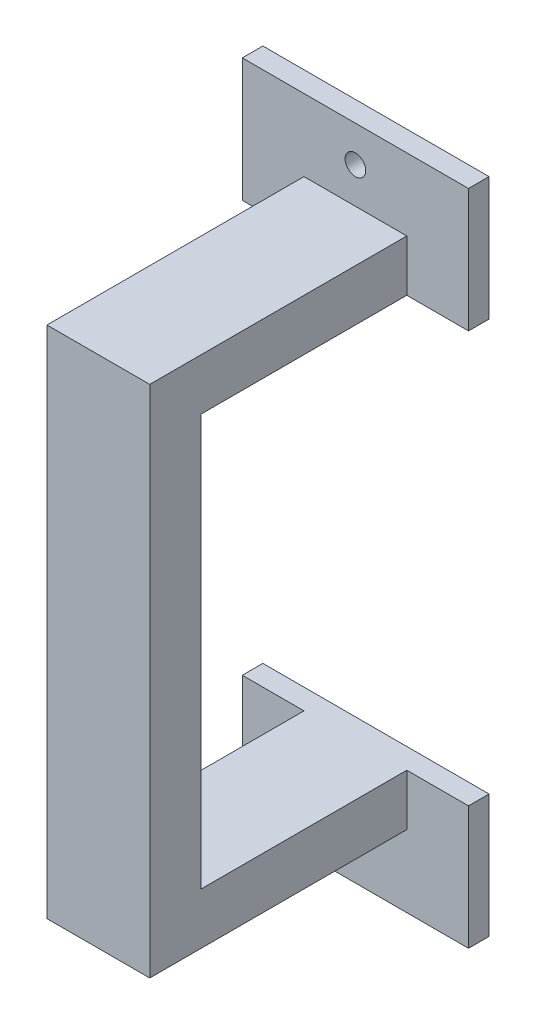
ISO-10303-21;
HEADER;
FILE_DESCRIPTION(('STEP AP214'),'2;1');
FILE_NAME('part.step','',(''),(''),'','','');
FILE_SCHEMA(('AUTOMOTIVE_DESIGN { 1 0 10303 214 1 1 1 1 }'));
ENDSEC;
DATA;
#1=APPLICATION_CONTEXT('core data for automotive mechanical design processes');
#2=APPLICATION_PROTOCOL_DEFINITION('international standard','automotive_design',2000,#1);
#3=PRODUCT_CONTEXT('',#1,'mechanical');
#4=PRODUCT('Part','Part','',(#3));
#5=PRODUCT_RELATED_PRODUCT_CATEGORY('part','',(#4));
#6=PRODUCT_DEFINITION_FORMATION('','',#4);
#7=PRODUCT_DEFINITION_CONTEXT('part definition',#1,'design');
#8=PRODUCT_DEFINITION('design','',#6,#7);
#9=PRODUCT_DEFINITION_SHAPE('','',#8);
#10=(LENGTH_UNIT() NAMED_UNIT(*) SI_UNIT(.MILLI.,.METRE.));
#11=(NAMED_UNIT(*) PLANE_ANGLE_UNIT() SI_UNIT($,.RADIAN.));
#12=(NAMED_UNIT(*) SI_UNIT($,.STERADIAN.) SOLID_ANGLE_UNIT());
#13=UNCERTAINTY_MEASURE_WITH_UNIT(LENGTH_MEASURE(1.E-05),#10,'distance_accuracy_value','');
#14=(GEOMETRIC_REPRESENTATION_CONTEXT(3) GLOBAL_UNCERTAINTY_ASSIGNED_CONTEXT((#13)) GLOBAL_UNIT_ASSIGNED_CONTEXT((#10,
#11,#12)) REPRESENTATION_CONTEXT('',''));
#15=CARTESIAN_POINT('',(0.,0.,0.));
#16=DIRECTION('',(0.,0.,1.));
#17=DIRECTION('',(1.,0.,0.));
#18=AXIS2_PLACEMENT_3D('',#15,#16,#17);
#19=CARTESIAN_POINT('',(12.7,44.0961272,0.));
#20=DIRECTION('',(0.,-1.,0.));
#21=DIRECTION('',(0.,0.,-1.));
#22=AXIS2_PLACEMENT_3D('',#19,#20,#21);
#23=PLANE('',#22);
#24=DIRECTION('',(0.,0.,1.));
#25=VECTOR('',#24,1.);
#26=CARTESIAN_POINT('',(0.,44.0961272,0.));
#27=LINE('',#26,#25);
#28=CARTESIAN_POINT('',(0.,44.0961272,0.));
#29=VERTEX_POINT('',#28);
#30=CARTESIAN_POINT('',(0.,44.0961272,31.75));
#31=VERTEX_POINT('',#30);
#32=EDGE_CURVE('E133',#29,#31,#27,.T.);
#33=ORIENTED_EDGE('',*,*,#32,.T.);
#34=DIRECTION('',(-1.,0.,0.));
#35=VECTOR('',#34,1.);
#36=CARTESIAN_POINT('',(12.7,44.0961272,31.75));
#37=LINE('',#36,#35);
#38=CARTESIAN_POINT('',(12.7,44.0961272,31.75));
#39=VERTEX_POINT('',#38);
#40=EDGE_CURVE('E44',#39,#31,#37,.T.);
#41=ORIENTED_EDGE('',*,*,#40,.F.);
#42=DIRECTION('',(0.,0.,1.));
#43=VECTOR('',#42,1.);
#44=CARTESIAN_POINT('',(12.7,44.0961272,0.));
#45=LINE('',#44,#43);
#46=CARTESIAN_POINT('',(12.7,44.0961272,0.));
#47=VERTEX_POINT('',#46);
#48=EDGE_CURVE('E91',#47,#39,#45,.T.);
#49=ORIENTED_EDGE('',*,*,#48,.F.);
#50=DIRECTION('',(-1.,0.,0.));
#51=VECTOR('',#50,1.);
#52=CARTESIAN_POINT('',(12.7,44.0961272,0.));
#53=LINE('',#52,#51);
#54=EDGE_CURVE('E11',#47,#29,#53,.T.);
#55=ORIENTED_EDGE('',*,*,#54,.T.);
#56=EDGE_LOOP('',(#33,#41,#49,#55));
#57=FACE_BOUND('',#56,.T.);
#58=ADVANCED_FACE('F36',(#57),#23,.F.);
#59=CARTESIAN_POINT('',(12.7,44.0961272,31.75));
#60=DIRECTION('',(0.,0.,-1.));
#61=DIRECTION('',(0.,1.,0.));
#62=AXIS2_PLACEMENT_3D('',#59,#60,#61);
#63=PLANE('',#62);
#64=DIRECTION('',(0.,-1.,0.));
#65=VECTOR('',#64,1.);
#66=CARTESIAN_POINT('',(0.,44.0961272,31.75));
#67=LINE('',#66,#65);
#68=CARTESIAN_POINT('',(0.,-19.4038728,31.75));
#69=VERTEX_POINT('',#68);
#70=EDGE_CURVE('E136',#31,#69,#67,.T.);
#71=ORIENTED_EDGE('',*,*,#70,.T.);
#72=DIRECTION('',(-1.,0.,0.));
#73=VECTOR('',#72,1.);
#74=CARTESIAN_POINT('',(12.7,-19.4038728,31.75));
#75=LINE('',#74,#73);
#76=CARTESIAN_POINT('',(12.7,-19.4038728,31.75));
#77=VERTEX_POINT('',#76);
#78=EDGE_CURVE('E150',#77,#69,#75,.T.);
#79=ORIENTED_EDGE('',*,*,#78,.F.);
#80=DIRECTION('',(0.,-1.,0.));
#81=VECTOR('',#80,1.);
#82=CARTESIAN_POINT('',(12.7,44.0961272,31.75));
#83=LINE('',#82,#81);
#84=EDGE_CURVE('E158',#39,#77,#83,.T.);
#85=ORIENTED_EDGE('',*,*,#84,.F.);
#86=ORIENTED_EDGE('',*,*,#40,.T.);
#87=EDGE_LOOP('',(#71,#79,#85,#86));
#88=FACE_BOUND('',#87,.T.);
#89=ADVANCED_FACE('F156',(#88),#63,.F.);
#90=CARTESIAN_POINT('',(12.7,-19.4038728,31.75));
#91=DIRECTION('',(0.,1.,0.));
#92=DIRECTION('',(0.,0.,1.));
#93=AXIS2_PLACEMENT_3D('',#90,#91,#92);
#94=PLANE('',#93);
#95=DIRECTION('',(0.,0.,-1.));
#96=VECTOR('',#95,1.);
#97=CARTESIAN_POINT('',(0.,-19.4038728,31.75));
#98=LINE('',#97,#96);
#99=CARTESIAN_POINT('',(0.,-19.4038728,0.));
#100=VERTEX_POINT('',#99);
#101=EDGE_CURVE('E138',#69,#100,#98,.T.);
#102=ORIENTED_EDGE('',*,*,#101,.T.);
#103=DIRECTION('',(-1.,0.,0.));
#104=VECTOR('',#103,1.);
#105=CARTESIAN_POINT('',(12.7,-19.4038728,0.));
#106=LINE('',#105,#104);
#107=CARTESIAN_POINT('',(12.7,-19.4038728,0.));
#108=VERTEX_POINT('',#107);
#109=EDGE_CURVE('E122',#108,#100,#106,.T.);
#110=ORIENTED_EDGE('',*,*,#109,.F.);
#111=DIRECTION('',(0.,0.,-1.));
#112=VECTOR('',#111,1.);
#113=CARTESIAN_POINT('',(12.7,-19.4038728,31.75));
#114=LINE('',#113,#112);
#115=EDGE_CURVE('E168',#77,#108,#114,.T.);
#116=ORIENTED_EDGE('',*,*,#115,.F.);
#117=ORIENTED_EDGE('',*,*,#78,.T.);
#118=EDGE_LOOP('',(#102,#110,#116,#117));
#119=FACE_BOUND('',#118,.T.);
#120=ADVANCED_FACE('F166',(#119),#94,.F.);
#121=CARTESIAN_POINT('',(12.7,-13.0538728,0.));
#122=DIRECTION('',(0.,-1.,0.));
#123=DIRECTION('',(0.,0.,-1.));
#124=AXIS2_PLACEMENT_3D('',#121,#122,#123);
#125=PLANE('',#124);
#126=DIRECTION('',(0.,0.,1.));
#127=VECTOR('',#126,1.);
#128=CARTESIAN_POINT('',(0.,-13.0538728,0.));
#129=LINE('',#128,#127);
#130=CARTESIAN_POINT('',(0.,-13.0538728,0.));
#131=VERTEX_POINT('',#130);
#132=CARTESIAN_POINT('',(0.,-13.0538728,25.4));
#133=VERTEX_POINT('',#132);
#134=EDGE_CURVE('E121',#131,#133,#129,.T.);
#135=ORIENTED_EDGE('',*,*,#134,.T.);
#136=DIRECTION('',(-1.,0.,0.));
#137=VECTOR('',#136,1.);
#138=CARTESIAN_POINT('',(12.7,-13.0538728,25.4));
#139=LINE('',#138,#137);
#140=CARTESIAN_POINT('',(12.7,-13.0538728,25.4));
#141=VERTEX_POINT('',#140);
#142=EDGE_CURVE('E117',#141,#133,#139,.T.);
#143=ORIENTED_EDGE('',*,*,#142,.F.);
#144=DIRECTION('',(0.,0.,1.));
#145=VECTOR('',#144,1.);
#146=CARTESIAN_POINT('',(12.7,-13.0538728,0.));
#147=LINE('',#146,#145);
#148=CARTESIAN_POINT('',(12.7,-13.0538728,0.));
#149=VERTEX_POINT('',#148);
#150=EDGE_CURVE('E106',#149,#141,#147,.T.);
#151=ORIENTED_EDGE('',*,*,#150,.F.);
#152=DIRECTION('',(1.,0.,0.));
#153=VECTOR('',#152,1.);
#154=CARTESIAN_POINT('',(20.32,-13.0538728,0.));
#155=LINE('',#154,#153);
#156=CARTESIAN_POINT('',(20.32,-13.0538728,0.));
#157=VERTEX_POINT('',#156);
#158=EDGE_CURVE('E235',#149,#157,#155,.T.);
#159=ORIENTED_EDGE('',*,*,#158,.T.);
#160=DIRECTION('',(0.,0.,1.));
#161=VECTOR('',#160,1.);
#162=CARTESIAN_POINT('',(20.32,-13.0538728,-2.53999999999999));
#163=LINE('',#162,#161);
#164=CARTESIAN_POINT('',(20.32,-13.0538728,-2.53999999999999));
#165=VERTEX_POINT('',#164);
#166=EDGE_CURVE('E222',#165,#157,#163,.T.);
#167=ORIENTED_EDGE('',*,*,#166,.F.);
#168=DIRECTION('',(1.,0.,0.));
#169=VECTOR('',#168,1.);
#170=CARTESIAN_POINT('',(20.32,-13.0538728,-2.53999999999999));
#171=LINE('',#170,#169);
#172=CARTESIAN_POINT('',(-7.62,-13.0538728,-2.53999999999999));
#173=VERTEX_POINT('',#172);
#174=EDGE_CURVE('E245',#173,#165,#171,.T.);
#175=ORIENTED_EDGE('',*,*,#174,.F.);
#176=DIRECTION('',(0.,0.,1.));
#177=VECTOR('',#176,1.);
#178=CARTESIAN_POINT('',(-7.62,-13.0538728,-2.53999999999999));
#179=LINE('',#178,#177);
#180=CARTESIAN_POINT('',(-7.62,-13.0538728,0.));
#181=VERTEX_POINT('',#180);
#182=EDGE_CURVE('E219',#173,#181,#179,.T.);
#183=ORIENTED_EDGE('',*,*,#182,.T.);
#184=EDGE_CURVE('E233',#181,#131,#155,.T.);
#185=ORIENTED_EDGE('',*,*,#184,.T.);
#186=EDGE_LOOP('',(#135,#143,#151,#159,#167,#175,#183,#185));
#187=FACE_BOUND('',#186,.T.);
#188=ADVANCED_FACE('F118',(#187),#125,.F.);
#189=CARTESIAN_POINT('',(12.7,-13.0538728,25.4));
#190=DIRECTION('',(0.,0.,1.));
#191=DIRECTION('',(1.,0.,0.));
#192=AXIS2_PLACEMENT_3D('',#189,#190,#191);
#193=PLANE('',#192);
#194=DIRECTION('',(0.,1.,0.));
#195=VECTOR('',#194,1.);
#196=CARTESIAN_POINT('',(0.,-13.0538728,25.4));
#197=LINE('',#196,#195);
#198=CARTESIAN_POINT('',(0.,37.7461272,25.4));
#199=VERTEX_POINT('',#198);
#200=EDGE_CURVE('E76',#133,#199,#197,.T.);
#201=ORIENTED_EDGE('',*,*,#200,.T.);
#202=DIRECTION('',(-1.,0.,0.));
#203=VECTOR('',#202,1.);
#204=CARTESIAN_POINT('',(12.7,37.7461272,25.4));
#205=LINE('',#204,#203);
#206=CARTESIAN_POINT('',(12.7,37.7461272,25.4));
#207=VERTEX_POINT('',#206);
#208=EDGE_CURVE('E123',#207,#199,#205,.T.);
#209=ORIENTED_EDGE('',*,*,#208,.F.);
#210=DIRECTION('',(0.,1.,0.));
#211=VECTOR('',#210,1.);
#212=CARTESIAN_POINT('',(12.7,-13.0538728,25.4));
#213=LINE('',#212,#211);
#214=EDGE_CURVE('E110',#141,#207,#213,.T.);
#215=ORIENTED_EDGE('',*,*,#214,.F.);
#216=ORIENTED_EDGE('',*,*,#142,.T.);
#217=EDGE_LOOP('',(#201,#209,#215,#216));
#218=FACE_BOUND('',#217,.T.);
#219=ADVANCED_FACE('F125',(#218),#193,.F.);
#220=CARTESIAN_POINT('',(12.7,37.7461272,25.4));
#221=DIRECTION('',(0.,1.,0.));
#222=DIRECTION('',(0.,0.,1.));
#223=AXIS2_PLACEMENT_3D('',#220,#221,#222);
#224=PLANE('',#223);
#225=DIRECTION('',(0.,0.,-1.));
#226=VECTOR('',#225,1.);
#227=CARTESIAN_POINT('',(0.,37.7461272,25.4));
#228=LINE('',#227,#226);
#229=CARTESIAN_POINT('',(0.,37.7461272,0.));
#230=VERTEX_POINT('',#229);
#231=EDGE_CURVE('E83',#199,#230,#228,.T.);
#232=ORIENTED_EDGE('',*,*,#231,.T.);
#233=DIRECTION('',(-1.,0.,0.));
#234=VECTOR('',#233,1.);
#235=CARTESIAN_POINT('',(20.32,37.7461272,0.));
#236=LINE('',#235,#234);
#237=CARTESIAN_POINT('',(-7.62,37.7461272,0.));
#238=VERTEX_POINT('',#237);
#239=EDGE_CURVE('E193',#230,#238,#236,.T.);
#240=ORIENTED_EDGE('',*,*,#239,.T.);
#241=DIRECTION('',(0.,0.,1.));
#242=VECTOR('',#241,1.);
#243=CARTESIAN_POINT('',(-7.62,37.7461272,-2.54000000000002));
#244=LINE('',#243,#242);
#245=CARTESIAN_POINT('',(-7.62,37.7461272,-2.54000000000002));
#246=VERTEX_POINT('',#245);
#247=EDGE_CURVE('E179',#246,#238,#244,.T.);
#248=ORIENTED_EDGE('',*,*,#247,.F.);
#249=DIRECTION('',(-1.,0.,0.));
#250=VECTOR('',#249,1.);
#251=CARTESIAN_POINT('',(20.32,37.7461272,-2.54000000000002));
#252=LINE('',#251,#250);
#253=CARTESIAN_POINT('',(20.32,37.7461272,-2.54000000000002));
#254=VERTEX_POINT('',#253);
#255=EDGE_CURVE('E203',#254,#246,#252,.T.);
#256=ORIENTED_EDGE('',*,*,#255,.F.);
#257=DIRECTION('',(0.,0.,1.));
#258=VECTOR('',#257,1.);
#259=CARTESIAN_POINT('',(20.32,37.7461272,-2.54000000000002));
#260=LINE('',#259,#258);
#261=CARTESIAN_POINT('',(20.32,37.7461272,0.));
#262=VERTEX_POINT('',#261);
#263=EDGE_CURVE('E176',#254,#262,#260,.T.);
#264=ORIENTED_EDGE('',*,*,#263,.T.);
#265=CARTESIAN_POINT('',(12.7,37.7461272,0.));
#266=VERTEX_POINT('',#265);
#267=EDGE_CURVE('E190',#262,#266,#236,.T.);
#268=ORIENTED_EDGE('',*,*,#267,.T.);
#269=DIRECTION('',(0.,0.,-1.));
#270=VECTOR('',#269,1.);
#271=CARTESIAN_POINT('',(12.7,37.7461272,25.4));
#272=LINE('',#271,#270);
#273=EDGE_CURVE('E52',#207,#266,#272,.T.);
#274=ORIENTED_EDGE('',*,*,#273,.F.);
#275=ORIENTED_EDGE('',*,*,#208,.T.);
#276=EDGE_LOOP('',(#232,#240,#248,#256,#264,#268,#274,#275));
#277=FACE_BOUND('',#276,.T.);
#278=ADVANCED_FACE('F350',(#277),#224,.F.);
#279=CARTESIAN_POINT('',(12.7,0.,0.));
#280=DIRECTION('',(1.,0.,0.));
#281=DIRECTION('',(0.,0.,-1.));
#282=AXIS2_PLACEMENT_3D('',#279,#280,#281);
#283=PLANE('',#282);
#284=DIRECTION('',(0.,1.,0.));
#285=VECTOR('',#284,1.);
#286=CARTESIAN_POINT('',(12.7,37.7461272,0.));
#287=LINE('',#286,#285);
#288=EDGE_CURVE('E146',#266,#47,#287,.T.);
#289=ORIENTED_EDGE('',*,*,#288,.T.);
#290=ORIENTED_EDGE('',*,*,#48,.T.);
#291=ORIENTED_EDGE('',*,*,#84,.T.);
#292=ORIENTED_EDGE('',*,*,#115,.T.);
#293=DIRECTION('',(0.,1.,0.));
#294=VECTOR('',#293,1.);
#295=CARTESIAN_POINT('',(12.7,-19.4038728,0.));
#296=LINE('',#295,#294);
#297=EDGE_CURVE('E112',#108,#149,#296,.T.);
#298=ORIENTED_EDGE('',*,*,#297,.T.);
#299=ORIENTED_EDGE('',*,*,#150,.T.);
#300=ORIENTED_EDGE('',*,*,#214,.T.);
#301=ORIENTED_EDGE('',*,*,#273,.T.);
#302=EDGE_LOOP('',(#289,#290,#291,#292,#298,#299,#300,#301));
#303=FACE_BOUND('',#302,.T.);
#304=ADVANCED_FACE('F108',(#303),#283,.T.);
#305=CARTESIAN_POINT('',(0.,0.,0.));
#306=DIRECTION('',(1.,0.,0.));
#307=DIRECTION('',(0.,0.,-1.));
#308=AXIS2_PLACEMENT_3D('',#305,#306,#307);
#309=PLANE('',#308);
#310=DIRECTION('',(0.,1.,0.));
#311=VECTOR('',#310,1.);
#312=CARTESIAN_POINT('',(0.,37.7461272,0.));
#313=LINE('',#312,#311);
#314=EDGE_CURVE('E130',#230,#29,#313,.T.);
#315=ORIENTED_EDGE('',*,*,#314,.F.);
#316=ORIENTED_EDGE('',*,*,#231,.F.);
#317=ORIENTED_EDGE('',*,*,#200,.F.);
#318=ORIENTED_EDGE('',*,*,#134,.F.);
#319=DIRECTION('',(0.,1.,0.));
#320=VECTOR('',#319,1.);
#321=CARTESIAN_POINT('',(0.,-19.4038728,0.));
#322=LINE('',#321,#320);
#323=EDGE_CURVE('E140',#100,#131,#322,.T.);
#324=ORIENTED_EDGE('',*,*,#323,.F.);
#325=ORIENTED_EDGE('',*,*,#101,.F.);
#326=ORIENTED_EDGE('',*,*,#70,.F.);
#327=ORIENTED_EDGE('',*,*,#32,.F.);
#328=EDGE_LOOP('',(#315,#316,#317,#318,#324,#325,#326,#327));
#329=FACE_BOUND('',#328,.T.);
#330=ADVANCED_FACE('F162',(#329),#309,.F.);
#331=CARTESIAN_POINT('',(0.,0.,-2.54));
#332=DIRECTION('',(0.,0.,1.));
#333=DIRECTION('',(0.,-1.,0.));
#334=AXIS2_PLACEMENT_3D('',#331,#332,#333);
#335=PLANE('',#334);
#336=DIRECTION('',(1.,0.,0.));
#337=VECTOR('',#336,1.);
#338=CARTESIAN_POINT('',(20.32,52.9861272,-2.54000000000003));
#339=LINE('',#338,#337);
#340=CARTESIAN_POINT('',(-7.62,52.9861272,-2.54000000000003));
#341=VERTEX_POINT('',#340);
#342=CARTESIAN_POINT('',(20.32,52.9861272,-2.54000000000003));
#343=VERTEX_POINT('',#342);
#344=EDGE_CURVE('E189',#341,#343,#339,.T.);
#345=ORIENTED_EDGE('',*,*,#344,.T.);
#346=DIRECTION('',(0.,-1.,0.));
#347=VECTOR('',#346,1.);
#348=CARTESIAN_POINT('',(20.32,52.9861272,-2.54000000000003));
#349=LINE('',#348,#347);
#350=EDGE_CURVE('E206',#343,#254,#349,.T.);
#351=ORIENTED_EDGE('',*,*,#350,.T.);
#352=ORIENTED_EDGE('',*,*,#255,.T.);
#353=DIRECTION('',(0.,1.,0.));
#354=VECTOR('',#353,1.);
#355=CARTESIAN_POINT('',(-7.62,52.9861272,-2.54000000000003));
#356=LINE('',#355,#354);
#357=EDGE_CURVE('E185',#246,#341,#356,.T.);
#358=ORIENTED_EDGE('',*,*,#357,.T.);
#359=EDGE_LOOP('',(#345,#351,#352,#358));
#360=FACE_BOUND('',#359,.T.);
#361=CARTESIAN_POINT('',(6.35,48.5411272,-2.54000000000002));
#362=DIRECTION('',(0.,0.,-1.));
#363=DIRECTION('',(0.,1.,0.));
#364=AXIS2_PLACEMENT_3D('',#361,#362,#363);
#365=CIRCLE('',#364,1.27);
#366=CARTESIAN_POINT('',(6.35,49.8111272,-2.54000000000002));
#367=VERTEX_POINT('',#366);
#368=EDGE_CURVE('E200',#367,#367,#365,.T.);
#369=ORIENTED_EDGE('',*,*,#368,.F.);
#370=EDGE_LOOP('',(#369));
#371=FACE_BOUND('',#370,.T.);
#372=ADVANCED_FACE('F348',(#360,#371),#335,.F.);
#373=CARTESIAN_POINT('',(0.,0.,0.));
#374=DIRECTION('',(0.,0.,1.));
#375=DIRECTION('',(0.,-1.,0.));
#376=AXIS2_PLACEMENT_3D('',#373,#374,#375);
#377=PLANE('',#376);
#378=ORIENTED_EDGE('',*,*,#54,.F.);
#379=ORIENTED_EDGE('',*,*,#288,.F.);
#380=ORIENTED_EDGE('',*,*,#267,.F.);
#381=DIRECTION('',(0.,-1.,0.));
#382=VECTOR('',#381,1.);
#383=CARTESIAN_POINT('',(20.32,52.9861272,0.));
#384=LINE('',#383,#382);
#385=CARTESIAN_POINT('',(20.32,52.9861272,0.));
#386=VERTEX_POINT('',#385);
#387=EDGE_CURVE('E194',#386,#262,#384,.T.);
#388=ORIENTED_EDGE('',*,*,#387,.F.);
#389=DIRECTION('',(1.,0.,0.));
#390=VECTOR('',#389,1.);
#391=CARTESIAN_POINT('',(20.32,52.9861272,0.));
#392=LINE('',#391,#390);
#393=CARTESIAN_POINT('',(-7.62,52.9861272,0.));
#394=VERTEX_POINT('',#393);
#395=EDGE_CURVE('E197',#394,#386,#392,.T.);
#396=ORIENTED_EDGE('',*,*,#395,.F.);
#397=DIRECTION('',(0.,1.,0.));
#398=VECTOR('',#397,1.);
#399=CARTESIAN_POINT('',(-7.62,52.9861272,0.));
#400=LINE('',#399,#398);
#401=EDGE_CURVE('E186',#238,#394,#400,.T.);
#402=ORIENTED_EDGE('',*,*,#401,.F.);
#403=ORIENTED_EDGE('',*,*,#239,.F.);
#404=ORIENTED_EDGE('',*,*,#314,.T.);
#405=EDGE_LOOP('',(#378,#379,#380,#388,#396,#402,#403,#404));
#406=FACE_BOUND('',#405,.T.);
#407=CARTESIAN_POINT('',(6.35,48.5411272,0.));
#408=DIRECTION('',(0.,0.,-1.));
#409=DIRECTION('',(0.,1.,0.));
#410=AXIS2_PLACEMENT_3D('',#407,#408,#409);
#411=CIRCLE('',#410,1.27);
#412=CARTESIAN_POINT('',(6.35,49.8111272,0.));
#413=VERTEX_POINT('',#412);
#414=EDGE_CURVE('E211',#413,#413,#411,.T.);
#415=ORIENTED_EDGE('',*,*,#414,.T.);
#416=EDGE_LOOP('',(#415));
#417=FACE_BOUND('',#416,.T.);
#418=ADVANCED_FACE('F286',(#406,#417),#377,.T.);
#419=CARTESIAN_POINT('',(20.32,52.9861272,-2.54000000000003));
#420=DIRECTION('',(0.,-1.,0.));
#421=DIRECTION('',(0.,0.,-1.));
#422=AXIS2_PLACEMENT_3D('',#419,#420,#421);
#423=PLANE('',#422);
#424=ORIENTED_EDGE('',*,*,#395,.T.);
#425=DIRECTION('',(0.,0.,1.));
#426=VECTOR('',#425,1.);
#427=CARTESIAN_POINT('',(20.32,52.9861272,-2.54000000000003));
#428=LINE('',#427,#426);
#429=EDGE_CURVE('E134',#343,#386,#428,.T.);
#430=ORIENTED_EDGE('',*,*,#429,.F.);
#431=ORIENTED_EDGE('',*,*,#344,.F.);
#432=DIRECTION('',(0.,0.,1.));
#433=VECTOR('',#432,1.);
#434=CARTESIAN_POINT('',(-7.62,52.9861272,-2.54000000000003));
#435=LINE('',#434,#433);
#436=EDGE_CURVE('E182',#341,#394,#435,.T.);
#437=ORIENTED_EDGE('',*,*,#436,.T.);
#438=EDGE_LOOP('',(#424,#430,#431,#437));
#439=FACE_BOUND('',#438,.T.);
#440=ADVANCED_FACE('F341',(#439),#423,.F.);
#441=CARTESIAN_POINT('',(20.32,52.9861272,-2.54000000000003));
#442=DIRECTION('',(-1.,0.,0.));
#443=DIRECTION('',(0.,0.,1.));
#444=AXIS2_PLACEMENT_3D('',#441,#442,#443);
#445=PLANE('',#444);
#446=ORIENTED_EDGE('',*,*,#387,.T.);
#447=ORIENTED_EDGE('',*,*,#263,.F.);
#448=ORIENTED_EDGE('',*,*,#350,.F.);
#449=ORIENTED_EDGE('',*,*,#429,.T.);
#450=EDGE_LOOP('',(#446,#447,#448,#449));
#451=FACE_BOUND('',#450,.T.);
#452=ADVANCED_FACE('F345',(#451),#445,.F.);
#453=CARTESIAN_POINT('',(-7.62,52.9861272,-2.54000000000003));
#454=DIRECTION('',(1.,0.,0.));
#455=DIRECTION('',(0.,0.,-1.));
#456=AXIS2_PLACEMENT_3D('',#453,#454,#455);
#457=PLANE('',#456);
#458=ORIENTED_EDGE('',*,*,#401,.T.);
#459=ORIENTED_EDGE('',*,*,#436,.F.);
#460=ORIENTED_EDGE('',*,*,#357,.F.);
#461=ORIENTED_EDGE('',*,*,#247,.T.);
#462=EDGE_LOOP('',(#458,#459,#460,#461));
#463=FACE_BOUND('',#462,.T.);
#464=ADVANCED_FACE('F275',(#463),#457,.F.);
#465=CARTESIAN_POINT('',(6.35,48.5411272,-2.54000000000002));
#466=DIRECTION('',(0.,0.,1.));
#467=DIRECTION('',(0.,-1.,0.));
#468=AXIS2_PLACEMENT_3D('',#465,#466,#467);
#469=CYLINDRICAL_SURFACE('',#468,1.27);
#470=ORIENTED_EDGE('',*,*,#368,.T.);
#471=EDGE_LOOP('',(#470));
#472=FACE_BOUND('',#471,.T.);
#473=ORIENTED_EDGE('',*,*,#414,.F.);
#474=EDGE_LOOP('',(#473));
#475=FACE_BOUND('',#474,.T.);
#476=ADVANCED_FACE('F265',(#472,#475),#469,.F.);
#477=CARTESIAN_POINT('',(0.,0.,-2.54));
#478=DIRECTION('',(0.,0.,-1.));
#479=DIRECTION('',(0.,1.,0.));
#480=AXIS2_PLACEMENT_3D('',#477,#478,#479);
#481=PLANE('',#480);
#482=DIRECTION('',(-1.,0.,0.));
#483=VECTOR('',#482,1.);
#484=CARTESIAN_POINT('',(20.32,-28.2938728000001,-2.53999999999999));
#485=LINE('',#484,#483);
#486=CARTESIAN_POINT('',(20.32,-28.2938728000001,-2.53999999999999));
#487=VERTEX_POINT('',#486);
#488=CARTESIAN_POINT('',(-7.62,-28.2938728000001,-2.53999999999999));
#489=VERTEX_POINT('',#488);
#490=EDGE_CURVE('E232',#487,#489,#485,.T.);
#491=ORIENTED_EDGE('',*,*,#490,.T.);
#492=DIRECTION('',(0.,1.,0.));
#493=VECTOR('',#492,1.);
#494=CARTESIAN_POINT('',(-7.62,-28.2938728000001,-2.53999999999999));
#495=LINE('',#494,#493);
#496=EDGE_CURVE('E248',#489,#173,#495,.T.);
#497=ORIENTED_EDGE('',*,*,#496,.T.);
#498=ORIENTED_EDGE('',*,*,#174,.T.);
#499=DIRECTION('',(0.,-1.,0.));
#500=VECTOR('',#499,1.);
#501=CARTESIAN_POINT('',(20.32,-28.2938728000001,-2.53999999999999));
#502=LINE('',#501,#500);
#503=EDGE_CURVE('E228',#165,#487,#502,.T.);
#504=ORIENTED_EDGE('',*,*,#503,.T.);
#505=EDGE_LOOP('',(#491,#497,#498,#504));
#506=FACE_BOUND('',#505,.T.);
#507=CARTESIAN_POINT('',(6.35,-23.8488728000001,-2.53999999999999));
#508=DIRECTION('',(0.,0.,-1.));
#509=DIRECTION('',(0.,-1.,0.));
#510=AXIS2_PLACEMENT_3D('',#507,#508,#509);
#511=CIRCLE('',#510,1.27);
#512=CARTESIAN_POINT('',(6.35,-25.1188728000001,-2.53999999999999));
#513=VERTEX_POINT('',#512);
#514=EDGE_CURVE('E242',#513,#513,#511,.T.);
#515=ORIENTED_EDGE('',*,*,#514,.F.);
#516=EDGE_LOOP('',(#515));
#517=FACE_BOUND('',#516,.T.);
#518=ADVANCED_FACE('F262',(#506,#517),#481,.T.);
#519=CARTESIAN_POINT('',(0.,0.,0.));
#520=DIRECTION('',(0.,0.,-1.));
#521=DIRECTION('',(0.,1.,0.));
#522=AXIS2_PLACEMENT_3D('',#519,#520,#521);
#523=PLANE('',#522);
#524=ORIENTED_EDGE('',*,*,#297,.F.);
#525=ORIENTED_EDGE('',*,*,#109,.T.);
#526=ORIENTED_EDGE('',*,*,#323,.T.);
#527=ORIENTED_EDGE('',*,*,#184,.F.);
#528=DIRECTION('',(0.,1.,0.));
#529=VECTOR('',#528,1.);
#530=CARTESIAN_POINT('',(-7.62,-28.2938728000001,0.));
#531=LINE('',#530,#529);
#532=CARTESIAN_POINT('',(-7.62,-28.2938728000001,0.));
#533=VERTEX_POINT('',#532);
#534=EDGE_CURVE('E236',#533,#181,#531,.T.);
#535=ORIENTED_EDGE('',*,*,#534,.F.);
#536=DIRECTION('',(-1.,0.,0.));
#537=VECTOR('',#536,1.);
#538=CARTESIAN_POINT('',(20.32,-28.2938728000001,0.));
#539=LINE('',#538,#537);
#540=CARTESIAN_POINT('',(20.32,-28.2938728000001,0.));
#541=VERTEX_POINT('',#540);
#542=EDGE_CURVE('E239',#541,#533,#539,.T.);
#543=ORIENTED_EDGE('',*,*,#542,.F.);
#544=DIRECTION('',(0.,-1.,0.));
#545=VECTOR('',#544,1.);
#546=CARTESIAN_POINT('',(20.32,-28.2938728000001,0.));
#547=LINE('',#546,#545);
#548=EDGE_CURVE('E229',#157,#541,#547,.T.);
#549=ORIENTED_EDGE('',*,*,#548,.F.);
#550=ORIENTED_EDGE('',*,*,#158,.F.);
#551=EDGE_LOOP('',(#524,#525,#526,#527,#535,#543,#549,#550));
#552=FACE_BOUND('',#551,.T.);
#553=CARTESIAN_POINT('',(6.35,-23.8488728000001,0.));
#554=DIRECTION('',(0.,0.,-1.));
#555=DIRECTION('',(0.,-1.,0.));
#556=AXIS2_PLACEMENT_3D('',#553,#554,#555);
#557=CIRCLE('',#556,1.27);
#558=CARTESIAN_POINT('',(6.35,-25.1188728000001,0.));
#559=VERTEX_POINT('',#558);
#560=EDGE_CURVE('E253',#559,#559,#557,.T.);
#561=ORIENTED_EDGE('',*,*,#560,.T.);
#562=EDGE_LOOP('',(#561));
#563=FACE_BOUND('',#562,.T.);
#564=ADVANCED_FACE('F264',(#552,#563),#523,.F.);
#565=CARTESIAN_POINT('',(20.32,-28.2938728000001,-2.53999999999999));
#566=DIRECTION('',(0.,1.,0.));
#567=DIRECTION('',(0.,0.,1.));
#568=AXIS2_PLACEMENT_3D('',#565,#566,#567);
#569=PLANE('',#568);
#570=ORIENTED_EDGE('',*,*,#542,.T.);
#571=DIRECTION('',(0.,0.,1.));
#572=VECTOR('',#571,1.);
#573=CARTESIAN_POINT('',(-7.62,-28.2938728000001,-2.53999999999999));
#574=LINE('',#573,#572);
#575=EDGE_CURVE('E214',#489,#533,#574,.T.);
#576=ORIENTED_EDGE('',*,*,#575,.F.);
#577=ORIENTED_EDGE('',*,*,#490,.F.);
#578=DIRECTION('',(0.,0.,1.));
#579=VECTOR('',#578,1.);
#580=CARTESIAN_POINT('',(20.32,-28.2938728000001,-2.53999999999999));
#581=LINE('',#580,#579);
#582=EDGE_CURVE('E225',#487,#541,#581,.T.);
#583=ORIENTED_EDGE('',*,*,#582,.T.);
#584=EDGE_LOOP('',(#570,#576,#577,#583));
#585=FACE_BOUND('',#584,.T.);
#586=ADVANCED_FACE('F272',(#585),#569,.F.);
#587=CARTESIAN_POINT('',(-7.62,-28.2938728000001,-2.53999999999999));
#588=DIRECTION('',(1.,0.,0.));
#589=DIRECTION('',(0.,0.,-1.));
#590=AXIS2_PLACEMENT_3D('',#587,#588,#589);
#591=PLANE('',#590);
#592=ORIENTED_EDGE('',*,*,#534,.T.);
#593=ORIENTED_EDGE('',*,*,#182,.F.);
#594=ORIENTED_EDGE('',*,*,#496,.F.);
#595=ORIENTED_EDGE('',*,*,#575,.T.);
#596=EDGE_LOOP('',(#592,#593,#594,#595));
#597=FACE_BOUND('',#596,.T.);
#598=ADVANCED_FACE('F308',(#597),#591,.F.);
#599=CARTESIAN_POINT('',(20.32,-28.2938728000001,-2.53999999999999));
#600=DIRECTION('',(-1.,0.,0.));
#601=DIRECTION('',(0.,0.,1.));
#602=AXIS2_PLACEMENT_3D('',#599,#600,#601);
#603=PLANE('',#602);
#604=ORIENTED_EDGE('',*,*,#548,.T.);
#605=ORIENTED_EDGE('',*,*,#582,.F.);
#606=ORIENTED_EDGE('',*,*,#503,.F.);
#607=ORIENTED_EDGE('',*,*,#166,.T.);
#608=EDGE_LOOP('',(#604,#605,#606,#607));
#609=FACE_BOUND('',#608,.T.);
#610=ADVANCED_FACE('F471',(#609),#603,.F.);
#611=CARTESIAN_POINT('',(6.35,-23.8488728000001,-2.53999999999999));
#612=DIRECTION('',(0.,0.,1.));
#613=DIRECTION('',(0.,-1.,0.));
#614=AXIS2_PLACEMENT_3D('',#611,#612,#613);
#615=CYLINDRICAL_SURFACE('',#614,1.27);
#616=ORIENTED_EDGE('',*,*,#514,.T.);
#617=EDGE_LOOP('',(#616));
#618=FACE_BOUND('',#617,.T.);
#619=ORIENTED_EDGE('',*,*,#560,.F.);
#620=EDGE_LOOP('',(#619));
#621=FACE_BOUND('',#620,.T.);
#622=ADVANCED_FACE('F259',(#618,#621),#615,.F.);
#623=CLOSED_SHELL('',(#58,#89,#120,#188,#219,#278,#304,#330,#372,#418,#440,#452,#464,#476,#518,
#564,#586,#598,#610,#622));
#624=MANIFOLD_SOLID_BREP('B2',#623);
#625=ADVANCED_BREP_SHAPE_REPRESENTATION('',(#18,#624),#14);
#626=SHAPE_DEFINITION_REPRESENTATION(#9,#625);
ENDSEC;
END-ISO-10303-21;
